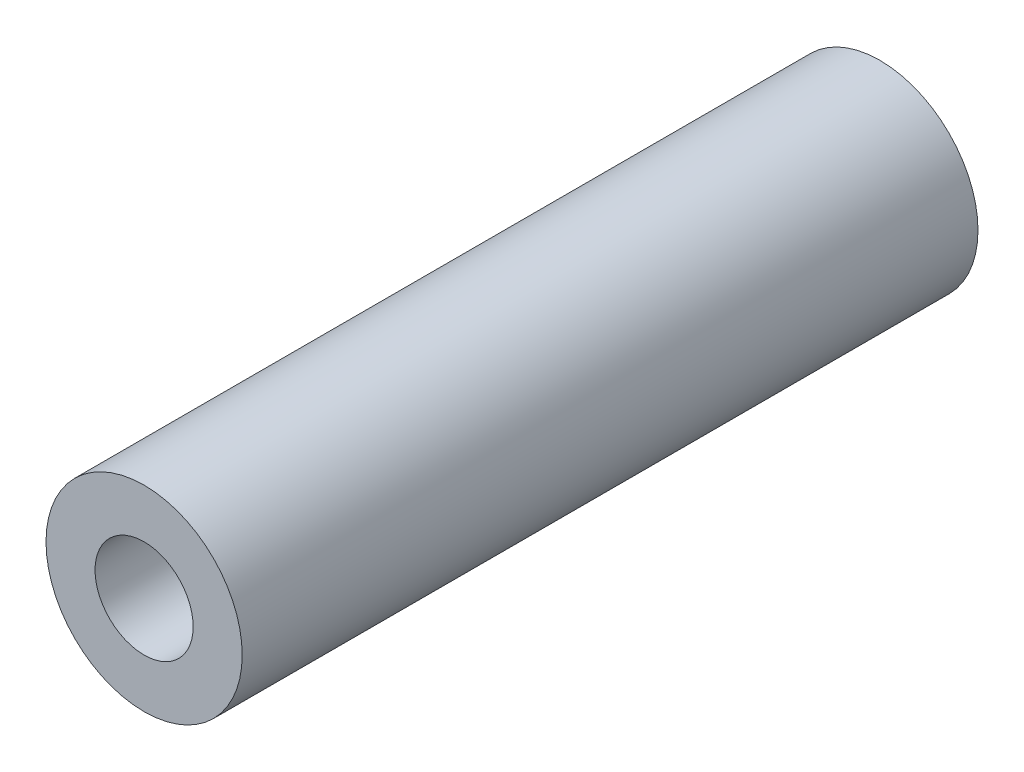
ISO-10303-21;
HEADER;
FILE_DESCRIPTION(('STEP AP214'),'2;1');
FILE_NAME('part.step','',(''),(''),'','','');
FILE_SCHEMA(('AUTOMOTIVE_DESIGN { 1 0 10303 214 1 1 1 1 }'));
ENDSEC;
DATA;
#1=APPLICATION_CONTEXT('core data for automotive mechanical design processes');
#2=APPLICATION_PROTOCOL_DEFINITION('international standard','automotive_design',2000,#1);
#3=PRODUCT_CONTEXT('',#1,'mechanical');
#4=PRODUCT('Part','Part','',(#3));
#5=PRODUCT_RELATED_PRODUCT_CATEGORY('part','',(#4));
#6=PRODUCT_DEFINITION_FORMATION('','',#4);
#7=PRODUCT_DEFINITION_CONTEXT('part definition',#1,'design');
#8=PRODUCT_DEFINITION('design','',#6,#7);
#9=PRODUCT_DEFINITION_SHAPE('','',#8);
#10=(LENGTH_UNIT() NAMED_UNIT(*) SI_UNIT(.MILLI.,.METRE.));
#11=(NAMED_UNIT(*) PLANE_ANGLE_UNIT() SI_UNIT($,.RADIAN.));
#12=(NAMED_UNIT(*) SI_UNIT($,.STERADIAN.) SOLID_ANGLE_UNIT());
#13=UNCERTAINTY_MEASURE_WITH_UNIT(LENGTH_MEASURE(1.E-05),#10,'distance_accuracy_value','');
#14=(GEOMETRIC_REPRESENTATION_CONTEXT(3) GLOBAL_UNCERTAINTY_ASSIGNED_CONTEXT((#13)) GLOBAL_UNIT_ASSIGNED_CONTEXT((#10,
#11,#12)) REPRESENTATION_CONTEXT('',''));
#15=CARTESIAN_POINT('',(0.,0.,0.));
#16=DIRECTION('',(0.,0.,1.));
#17=DIRECTION('',(1.,0.,0.));
#18=AXIS2_PLACEMENT_3D('',#15,#16,#17);
#19=CARTESIAN_POINT('',(0.,0.,30.));
#20=DIRECTION('',(0.,0.,1.));
#21=DIRECTION('',(1.,0.,0.));
#22=AXIS2_PLACEMENT_3D('',#19,#20,#21);
#23=PLANE('',#22);
#24=CARTESIAN_POINT('',(0.,0.,30.));
#25=DIRECTION('',(0.,0.,1.));
#26=DIRECTION('',(1.,0.,0.));
#27=AXIS2_PLACEMENT_3D('',#24,#25,#26);
#28=CIRCLE('',#27,4.);
#29=CARTESIAN_POINT('',(4.,0.,30.));
#30=VERTEX_POINT('',#29);
#31=EDGE_CURVE('E10',#30,#30,#28,.T.);
#32=ORIENTED_EDGE('',*,*,#31,.T.);
#33=EDGE_LOOP('',(#32));
#34=FACE_BOUND('',#33,.T.);
#35=CARTESIAN_POINT('',(0.,0.,30.));
#36=DIRECTION('',(0.,0.,1.));
#37=DIRECTION('',(1.,0.,0.));
#38=AXIS2_PLACEMENT_3D('',#35,#36,#37);
#39=CIRCLE('',#38,2.);
#40=CARTESIAN_POINT('',(2.,0.,30.));
#41=VERTEX_POINT('',#40);
#42=EDGE_CURVE('E42',#41,#41,#39,.T.);
#43=ORIENTED_EDGE('',*,*,#42,.F.);
#44=EDGE_LOOP('',(#43));
#45=FACE_BOUND('',#44,.T.);
#46=ADVANCED_FACE('F31',(#34,#45),#23,.T.);
#47=CARTESIAN_POINT('',(0.,0.,0.));
#48=DIRECTION('',(0.,0.,1.));
#49=DIRECTION('',(1.,0.,0.));
#50=AXIS2_PLACEMENT_3D('',#47,#48,#49);
#51=PLANE('',#50);
#52=CARTESIAN_POINT('',(0.,0.,0.));
#53=DIRECTION('',(0.,0.,1.));
#54=DIRECTION('',(1.,0.,0.));
#55=AXIS2_PLACEMENT_3D('',#52,#53,#54);
#56=CIRCLE('',#55,4.);
#57=CARTESIAN_POINT('',(4.,0.,0.));
#58=VERTEX_POINT('',#57);
#59=EDGE_CURVE('E35',#58,#58,#56,.T.);
#60=ORIENTED_EDGE('',*,*,#59,.F.);
#61=EDGE_LOOP('',(#60));
#62=FACE_BOUND('',#61,.T.);
#63=CARTESIAN_POINT('',(0.,0.,0.));
#64=DIRECTION('',(0.,0.,1.));
#65=DIRECTION('',(1.,0.,0.));
#66=AXIS2_PLACEMENT_3D('',#63,#64,#65);
#67=CIRCLE('',#66,2.);
#68=CARTESIAN_POINT('',(2.,0.,0.));
#69=VERTEX_POINT('',#68);
#70=EDGE_CURVE('E44',#69,#69,#67,.T.);
#71=ORIENTED_EDGE('',*,*,#70,.T.);
#72=EDGE_LOOP('',(#71));
#73=FACE_BOUND('',#72,.T.);
#74=ADVANCED_FACE('F54',(#62,#73),#51,.F.);
#75=CARTESIAN_POINT('',(0.,0.,30.));
#76=DIRECTION('',(0.,0.,-1.));
#77=DIRECTION('',(-1.,0.,0.));
#78=AXIS2_PLACEMENT_3D('',#75,#76,#77);
#79=CYLINDRICAL_SURFACE('',#78,4.);
#80=ORIENTED_EDGE('',*,*,#31,.F.);
#81=EDGE_LOOP('',(#80));
#82=FACE_BOUND('',#81,.T.);
#83=ORIENTED_EDGE('',*,*,#59,.T.);
#84=EDGE_LOOP('',(#83));
#85=FACE_BOUND('',#84,.T.);
#86=ADVANCED_FACE('F33',(#82,#85),#79,.T.);
#87=CARTESIAN_POINT('',(0.,0.,30.));
#88=DIRECTION('',(0.,0.,-1.));
#89=DIRECTION('',(-1.,0.,0.));
#90=AXIS2_PLACEMENT_3D('',#87,#88,#89);
#91=CYLINDRICAL_SURFACE('',#90,2.);
#92=ORIENTED_EDGE('',*,*,#42,.T.);
#93=EDGE_LOOP('',(#92));
#94=FACE_BOUND('',#93,.T.);
#95=ORIENTED_EDGE('',*,*,#70,.F.);
#96=EDGE_LOOP('',(#95));
#97=FACE_BOUND('',#96,.T.);
#98=ADVANCED_FACE('F50',(#94,#97),#91,.F.);
#99=CLOSED_SHELL('',(#46,#74,#86,#98));
#100=MANIFOLD_SOLID_BREP('B2',#99);
#101=ADVANCED_BREP_SHAPE_REPRESENTATION('',(#18,#100),#14);
#102=SHAPE_DEFINITION_REPRESENTATION(#9,#101);
ENDSEC;
END-ISO-10303-21;
